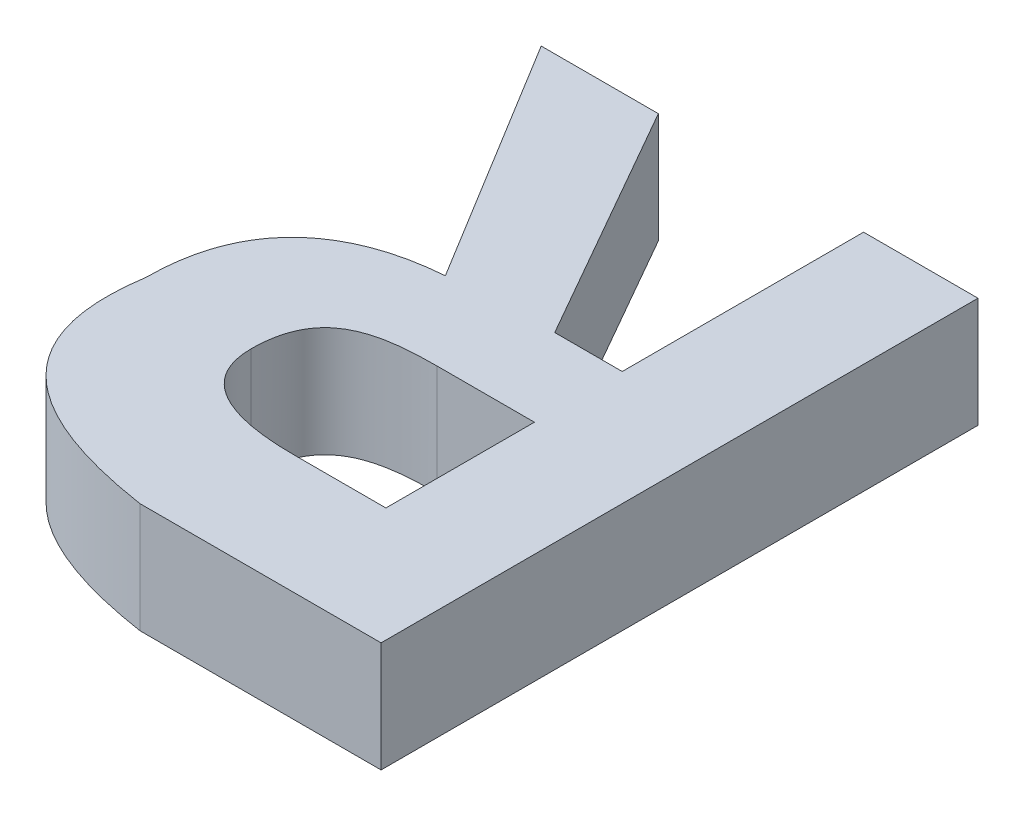
ISO-10303-21;
HEADER;
FILE_DESCRIPTION(('STEP AP214'),'2;1');
FILE_NAME('part.step','',(''),(''),'','','');
FILE_SCHEMA(('AUTOMOTIVE_DESIGN { 1 0 10303 214 1 1 1 1 }'));
ENDSEC;
DATA;
#1=APPLICATION_CONTEXT('core data for automotive mechanical design processes');
#2=APPLICATION_PROTOCOL_DEFINITION('international standard','automotive_design',2000,#1);
#3=PRODUCT_CONTEXT('',#1,'mechanical');
#4=PRODUCT('Part','Part','',(#3));
#5=PRODUCT_RELATED_PRODUCT_CATEGORY('part','',(#4));
#6=PRODUCT_DEFINITION_FORMATION('','',#4);
#7=PRODUCT_DEFINITION_CONTEXT('part definition',#1,'design');
#8=PRODUCT_DEFINITION('design','',#6,#7);
#9=PRODUCT_DEFINITION_SHAPE('','',#8);
#10=(LENGTH_UNIT() NAMED_UNIT(*) SI_UNIT(.MILLI.,.METRE.));
#11=(NAMED_UNIT(*) PLANE_ANGLE_UNIT() SI_UNIT($,.RADIAN.));
#12=(NAMED_UNIT(*) SI_UNIT($,.STERADIAN.) SOLID_ANGLE_UNIT());
#13=UNCERTAINTY_MEASURE_WITH_UNIT(LENGTH_MEASURE(1.E-05),#10,'distance_accuracy_value','');
#14=(GEOMETRIC_REPRESENTATION_CONTEXT(3) GLOBAL_UNCERTAINTY_ASSIGNED_CONTEXT((#13)) GLOBAL_UNIT_ASSIGNED_CONTEXT((#10,
#11,#12)) REPRESENTATION_CONTEXT('',''));
#15=CARTESIAN_POINT('',(0.,0.,0.));
#16=DIRECTION('',(0.,0.,1.));
#17=DIRECTION('',(1.,0.,0.));
#18=AXIS2_PLACEMENT_3D('',#15,#16,#17);
#19=CARTESIAN_POINT('',(-26.090925044,12.954,-113.771662691));
#20=DIRECTION('',(0.,1.,0.));
#21=DIRECTION('',(0.,0.,1.));
#22=AXIS2_PLACEMENT_3D('',#19,#20,#21);
#23=PLANE('',#22);
#24=DIRECTION('',(-1.,0.,0.));
#25=VECTOR('',#24,1.);
#26=CARTESIAN_POINT('',(-25.449607533,12.954,-113.012308525));
#27=LINE('',#26,#25);
#28=CARTESIAN_POINT('',(-25.3373249810244,12.954,-113.012308524818));
#29=VERTEX_POINT('',#28);
#30=CARTESIAN_POINT('',(-25.5618900849623,12.954,-113.012308525));
#31=VERTEX_POINT('',#30);
#32=EDGE_CURVE('E153',#29,#31,#27,.T.);
#33=ORIENTED_EDGE('',*,*,#32,.F.);
#34=DIRECTION('',(0.,0.,-1.));
#35=VECTOR('',#34,1.);
#36=CARTESIAN_POINT('',(-25.337324981,12.954,-112.8409908165));
#37=LINE('',#36,#35);
#38=CARTESIAN_POINT('',(-25.3373249810366,12.954,-112.66967310799));
#39=VERTEX_POINT('',#38);
#40=EDGE_CURVE('E148',#39,#29,#37,.T.);
#41=ORIENTED_EDGE('',*,*,#40,.F.);
#42=DIRECTION('',(1.,0.,0.));
#43=VECTOR('',#42,1.);
#44=CARTESIAN_POINT('',(-25.4432409965,12.954,-112.669673108));
#45=LINE('',#44,#43);
#46=CARTESIAN_POINT('',(-25.5491570120707,12.954,-112.669673108));
#47=VERTEX_POINT('',#46);
#48=EDGE_CURVE('E143',#47,#39,#45,.T.);
#49=ORIENTED_EDGE('',*,*,#48,.F.);
#50=CARTESIAN_POINT('',(-25.810763783,12.954,-112.831730399406));
#51=CARTESIAN_POINT('',(-25.8107776302854,12.954,-112.823246137175));
#52=CARTESIAN_POINT('',(-25.8102176620083,12.954,-112.814713134703));
#53=CARTESIAN_POINT('',(-25.8077368192563,12.954,-112.797807767082));
#54=CARTESIAN_POINT('',(-25.8058087399107,12.954,-112.789436494447));
#55=CARTESIAN_POINT('',(-25.8008261546182,12.954,-112.774559777378));
#56=CARTESIAN_POINT('',(-25.7980125754551,12.954,-112.767975704532));
#57=CARTESIAN_POINT('',(-25.7913051876619,12.954,-112.75541106041));
#58=CARTESIAN_POINT('',(-25.7874151974175,12.954,-112.749428455956));
#59=CARTESIAN_POINT('',(-25.778687248921,12.954,-112.738215859253));
#60=CARTESIAN_POINT('',(-25.7738503605541,12.954,-112.732985029048));
#61=CARTESIAN_POINT('',(-25.7634318066707,12.954,-112.723324557742));
#62=CARTESIAN_POINT('',(-25.757849109587,12.954,-112.718896046727));
#63=CARTESIAN_POINT('',(-25.7429409929256,12.954,-112.708592809806));
#64=CARTESIAN_POINT('',(-25.7332439867889,12.954,-112.703259638791));
#65=CARTESIAN_POINT('',(-25.7131033044583,12.954,-112.694095293888));
#66=CARTESIAN_POINT('',(-25.7026540322686,12.954,-112.690277135416));
#67=CARTESIAN_POINT('',(-25.680293518783,12.954,-112.683505543826));
#68=CARTESIAN_POINT('',(-25.6683435615107,12.954,-112.680684057106));
#69=CARTESIAN_POINT('',(-25.6442171688885,12.954,-112.676138005697));
#70=CARTESIAN_POINT('',(-25.6320402376618,12.954,-112.674416230119));
#71=CARTESIAN_POINT('',(-25.6080562417876,12.954,-112.671866120748));
#72=CARTESIAN_POINT('',(-25.5962522394757,12.954,-112.671006975831));
#73=CARTESIAN_POINT('',(-25.5726815681535,12.954,-112.669915418162));
#74=CARTESIAN_POINT('',(-25.5609150717793,12.954,-112.669679448772));
#75=CARTESIAN_POINT('',(-25.5491570121413,12.954,-112.669673108));
#76=B_SPLINE_CURVE_WITH_KNOTS('',3,(#50,#51,#52,#53,#54,#55,#56,#57,#58,#59,#60,#61,#62,#63,#64,
#65,#66,#67,#68,#69,#70,#71,#72,#73,#74,#75),.UNSPECIFIED.,.F.,.F.,(4,2,2,2,2,2,2,2,2,2,2,2,4),
(0.,0.0255099891125223,0.0511553279690348,0.0725317902280279,0.0938333743057024,
0.115111027544454,0.136418421765181,0.169428371635405,0.202716068199506,0.239480073503482,
0.276336954015739,0.311824792851989,0.347109650499031),.UNSPECIFIED.);
#77=CARTESIAN_POINT('',(-25.810763783,12.954,-112.831730399406));
#78=VERTEX_POINT('',#77);
#79=EDGE_CURVE('E228',#78,#47,#76,.T.);
#80=ORIENTED_EDGE('',*,*,#79,.F.);
#81=CARTESIAN_POINT('',(-25.5618900849246,12.954,-113.012308525));
#82=CARTESIAN_POINT('',(-25.5719312912442,12.954,-113.012301866117));
#83=CARTESIAN_POINT('',(-25.5819776566971,12.954,-113.012194755488));
#84=CARTESIAN_POINT('',(-25.6021052033692,12.954,-113.011629515633));
#85=CARTESIAN_POINT('',(-25.6121863360742,12.954,-113.011169798059));
#86=CARTESIAN_POINT('',(-25.6325860474253,12.954,-113.009727520731));
#87=CARTESIAN_POINT('',(-25.6429037559209,12.954,-113.008731290467));
#88=CARTESIAN_POINT('',(-25.6634238005514,12.954,-113.005973771035));
#89=CARTESIAN_POINT('',(-25.6736263245699,12.954,-113.004213999513));
#90=CARTESIAN_POINT('',(-25.6923369632769,12.954,-112.999941328749));
#91=CARTESIAN_POINT('',(-25.7008769587077,12.954,-112.997573930636));
#92=CARTESIAN_POINT('',(-25.7175752585948,12.954,-112.991800071061));
#93=CARTESIAN_POINT('',(-25.725734928069,12.954,-112.988397719166));
#94=CARTESIAN_POINT('',(-25.7415493628911,12.954,-112.980220518709));
#95=CARTESIAN_POINT('',(-25.7491922015037,12.954,-112.975421763746));
#96=CARTESIAN_POINT('',(-25.7633313884719,12.954,-112.964364008087));
#97=CARTESIAN_POINT('',(-25.7698306397209,12.954,-112.958108801163));
#98=CARTESIAN_POINT('',(-25.7804534282194,12.954,-112.945381473812));
#99=CARTESIAN_POINT('',(-25.7847871672812,12.954,-112.939083016556));
#100=CARTESIAN_POINT('',(-25.7923219404625,12.954,-112.925837017911));
#101=CARTESIAN_POINT('',(-25.795520952524,12.954,-112.918888345414));
#102=CARTESIAN_POINT('',(-25.8020125067607,12.954,-112.901584134861));
#103=CARTESIAN_POINT('',(-25.8047708397115,12.954,-112.891032114872));
#104=CARTESIAN_POINT('',(-25.8086745332376,12.954,-112.869648657799));
#105=CARTESIAN_POINT('',(-25.8098167899889,12.954,-112.858816723613));
#106=CARTESIAN_POINT('',(-25.8106357418109,12.954,-112.842551570542));
#107=CARTESIAN_POINT('',(-25.8107602876309,12.954,-112.837137750845));
#108=CARTESIAN_POINT('',(-25.810763783,12.954,-112.831730399406));
#109=B_SPLINE_CURVE_WITH_KNOTS('',3,(#81,#82,#83,#84,#85,#86,#87,#88,#89,#90,#91,#92,#93,#94,
#95,#96,#97,#98,#99,#100,#101,#102,#103,#104,#105,#106,#107,#108),.UNSPECIFIED.,.F.,.F.,(4,2,2,
2,2,2,2,2,2,2,2,2,2,4),(0.,0.0301311950720296,0.060398921498261,0.0914771258709669,
0.122493838815301,0.149030364951006,0.175462866363666,0.202377581623978,0.229222958484002,
0.252036607466527,0.274890708007287,0.307424124795699,0.340019940592904,0.356253469182413),.UNSPECIFIED.);
#110=EDGE_CURVE('E219',#31,#78,#109,.T.);
#111=ORIENTED_EDGE('',*,*,#110,.F.);
#112=EDGE_LOOP('',(#33,#41,#49,#80,#111));
#113=FACE_BOUND('',#112,.T.);
#114=DIRECTION('',(0.495652722488947,0.,0.868520799226648));
#115=VECTOR('',#114,1.);
#116=CARTESIAN_POINT('',(-25.6518897595,12.954,-113.493271415));
#117=LINE('',#116,#115);
#118=CARTESIAN_POINT('',(-25.8107637830514,12.954,-113.771662691));
#119=VERTEX_POINT('',#118);
#120=CARTESIAN_POINT('',(-25.4930157360467,12.954,-113.214880138876));
#121=VERTEX_POINT('',#120);
#122=EDGE_CURVE('E179',#119,#121,#117,.T.);
#123=ORIENTED_EDGE('',*,*,#122,.F.);
#124=DIRECTION('',(1.,0.,0.));
#125=VECTOR('',#124,1.);
#126=CARTESIAN_POINT('',(-25.9459079885,12.954,-113.771662691));
#127=LINE('',#126,#125);
#128=CARTESIAN_POINT('',(-26.0810521941043,12.954,-113.771662691036));
#129=VERTEX_POINT('',#128);
#130=EDGE_CURVE('E113',#129,#119,#127,.T.);
#131=ORIENTED_EDGE('',*,*,#130,.F.);
#132=DIRECTION('',(-0.521870730900118,0.,-0.853024583602241));
#133=VECTOR('',#132,1.);
#134=CARTESIAN_POINT('',(-25.9068406055,12.954,-113.4869048785));
#135=LINE('',#134,#133);
#136=CARTESIAN_POINT('',(-25.7326290170488,12.954,-113.202147065996));
#137=VERTEX_POINT('',#136);
#138=EDGE_CURVE('E110',#137,#129,#135,.T.);
#139=ORIENTED_EDGE('',*,*,#138,.F.);
#140=CARTESIAN_POINT('',(-26.074685658,12.954,-112.853723889036));
#141=CARTESIAN_POINT('',(-26.0746832927,12.954,-112.87635047769));
#142=CARTESIAN_POINT('',(-26.07335310071,12.954,-112.899168006339));
#143=CARTESIAN_POINT('',(-26.0671126607881,12.954,-112.944583141224));
#144=CARTESIAN_POINT('',(-26.0621563166214,12.954,-112.967174082605));
#145=CARTESIAN_POINT('',(-26.0498770538995,12.954,-113.004297306721));
#146=CARTESIAN_POINT('',(-26.0437213079397,12.954,-113.01920247324));
#147=CARTESIAN_POINT('',(-26.0290484920645,12.954,-113.047718809214));
#148=CARTESIAN_POINT('',(-26.0205441464802,12.954,-113.061336435204));
#149=CARTESIAN_POINT('',(-26.0011982367447,12.954,-113.086916820569));
#150=CARTESIAN_POINT('',(-25.9903446329658,12.954,-113.098870513654));
#151=CARTESIAN_POINT('',(-25.966700746293,12.954,-113.120701854276));
#152=CARTESIAN_POINT('',(-25.9539072312247,12.954,-113.130575970085));
#153=CARTESIAN_POINT('',(-25.9237998626526,12.954,-113.150200195015));
#154=CARTESIAN_POINT('',(-25.9061253965113,12.954,-113.159391710226));
#155=CARTESIAN_POINT('',(-25.8695024228251,12.954,-113.174848979438));
#156=CARTESIAN_POINT('',(-25.8505490825181,12.954,-113.181102831974));
#157=CARTESIAN_POINT('',(-25.8150611136051,12.954,-113.190365573586));
#158=CARTESIAN_POINT('',(-25.7986145017672,12.954,-113.193729978415));
#159=CARTESIAN_POINT('',(-25.7656606072858,12.954,-113.198963055576));
#160=CARTESIAN_POINT('',(-25.7491558435457,12.954,-113.200847301286));
#161=CARTESIAN_POINT('',(-25.7326290170977,12.954,-113.202147065992));
#162=B_SPLINE_CURVE_WITH_KNOTS('',3,(#140,#141,#142,#143,#144,#145,#146,#147,#148,#149,#150,
#151,#152,#153,#154,#155,#156,#157,#158,#159,#160,#161),.UNSPECIFIED.,.F.,.F.,(4,2,2,2,2,2,2,2,
2,2,4),(0.,0.0681500460575748,0.137181819994094,0.185360477353473,0.233283065163485,
0.281457323972136,0.329712748443763,0.389146600500817,0.448819205587135,0.499113530626107,
0.548871323060384),.UNSPECIFIED.);
#163=CARTESIAN_POINT('',(-26.0746856579945,12.954,-112.853723889054));
#164=VERTEX_POINT('',#163);
#165=EDGE_CURVE('E22',#164,#137,#162,.T.);
#166=ORIENTED_EDGE('',*,*,#165,.F.);
#167=CARTESIAN_POINT('',(-25.6298959589762,12.954,-112.394654170996));
#168=CARTESIAN_POINT('',(-25.6527922911345,12.954,-112.398226128867));
#169=CARTESIAN_POINT('',(-25.675636746028,12.954,-112.402271238563));
#170=CARTESIAN_POINT('',(-25.7212417198629,12.954,-112.411704988264));
#171=CARTESIAN_POINT('',(-25.7439999459293,12.954,-112.41710456262));
#172=CARTESIAN_POINT('',(-25.7903690147002,12.954,-112.42995864268));
#173=CARTESIAN_POINT('',(-25.8139529180023,12.954,-112.437514036143));
#174=CARTESIAN_POINT('',(-25.8601031972738,12.954,-112.455129826824));
#175=CARTESIAN_POINT('',(-25.8826729446044,12.954,-112.465181066093));
#176=CARTESIAN_POINT('',(-25.9256385337015,12.954,-112.488358546919));
#177=CARTESIAN_POINT('',(-25.9460697325638,12.954,-112.501416749718));
#178=CARTESIAN_POINT('',(-25.9836523361731,12.954,-112.531228359708));
#179=CARTESIAN_POINT('',(-26.0008503334594,12.954,-112.547920321955));
#180=CARTESIAN_POINT('',(-26.026187034835,12.954,-112.579430965283));
#181=CARTESIAN_POINT('',(-26.035495788569,12.954,-112.593309880974));
#182=CARTESIAN_POINT('',(-26.0515170403732,12.954,-112.622526437535));
#183=CARTESIAN_POINT('',(-26.0582247557941,12.954,-112.637866701567));
#184=CARTESIAN_POINT('',(-26.0689422009236,12.954,-112.669316414517));
#185=CARTESIAN_POINT('',(-26.072972094957,12.954,-112.685419113396));
#186=CARTESIAN_POINT('',(-26.078704807968,12.954,-112.718044023868));
#187=CARTESIAN_POINT('',(-26.0804011254355,12.954,-112.734567277412));
#188=CARTESIAN_POINT('',(-26.0825948489605,12.954,-112.785435640346));
#189=CARTESIAN_POINT('',(-26.0798832411116,12.954,-112.819990422207));
#190=CARTESIAN_POINT('',(-26.0746856579889,12.954,-112.853723889071));
#191=B_SPLINE_CURVE_WITH_KNOTS('',3,(#167,#168,#169,#170,#171,#172,#173,#174,#175,#176,#177,
#178,#179,#180,#181,#182,#183,#184,#185,#186,#187,#188,#189,#190),.UNSPECIFIED.,.F.,.F.,(4,2,2,
2,2,2,2,2,2,2,2,4),(0.,0.0695473820484863,0.139675370769989,0.213864202745999,0.287784737012076,
0.360173436055242,0.43142190335044,0.481300441560027,0.531270263704793,0.580859409112938,
0.63058643549624,0.733357096768972),.UNSPECIFIED.);
#192=CARTESIAN_POINT('',(-25.6298959589881,12.954,-112.394654170998));
#193=VERTEX_POINT('',#192);
#194=EDGE_CURVE('E239',#193,#164,#191,.T.);
#195=ORIENTED_EDGE('',*,*,#194,.F.);
#196=DIRECTION('',(-1.,0.,0.));
#197=VECTOR('',#196,1.);
#198=CARTESIAN_POINT('',(-25.3516495325,12.954,-112.394654171));
#199=LINE('',#198,#197);
#200=CARTESIAN_POINT('',(-25.073403106,12.954,-112.394654171));
#201=VERTEX_POINT('',#200);
#202=EDGE_CURVE('E164',#201,#193,#199,.T.);
#203=ORIENTED_EDGE('',*,*,#202,.F.);
#204=DIRECTION('',(0.,0.,1.));
#205=VECTOR('',#204,1.);
#206=CARTESIAN_POINT('',(-25.073403106,12.954,-113.083158431));
#207=LINE('',#206,#205);
#208=CARTESIAN_POINT('',(-25.073403106,12.954,-113.771662691));
#209=VERTEX_POINT('',#208);
#210=EDGE_CURVE('E171',#209,#201,#207,.T.);
#211=ORIENTED_EDGE('',*,*,#210,.F.);
#212=DIRECTION('',(1.,0.,0.));
#213=VECTOR('',#212,1.);
#214=CARTESIAN_POINT('',(-25.2053640435,12.954,-113.771662691));
#215=LINE('',#214,#213);
#216=CARTESIAN_POINT('',(-25.3373249810549,12.954,-113.771662691));
#217=VERTEX_POINT('',#216);
#218=EDGE_CURVE('E297',#217,#209,#215,.T.);
#219=ORIENTED_EDGE('',*,*,#218,.F.);
#220=DIRECTION('',(0.,0.,-1.));
#221=VECTOR('',#220,1.);
#222=CARTESIAN_POINT('',(-25.337324981,12.954,-113.493271415));
#223=LINE('',#222,#221);
#224=CARTESIAN_POINT('',(-25.3373249810549,12.954,-113.214880138876));
#225=VERTEX_POINT('',#224);
#226=EDGE_CURVE('E303',#225,#217,#223,.T.);
#227=ORIENTED_EDGE('',*,*,#226,.F.);
#228=DIRECTION('',(1.,0.,0.));
#229=VECTOR('',#228,1.);
#230=CARTESIAN_POINT('',(-25.4151703585,12.954,-113.214880139));
#231=LINE('',#230,#229);
#232=EDGE_CURVE('E180',#121,#225,#231,.T.);
#233=ORIENTED_EDGE('',*,*,#232,.F.);
#234=EDGE_LOOP('',(#123,#131,#139,#166,#195,#203,#211,#219,#227,#233));
#235=FACE_BOUND('',#234,.T.);
#236=ADVANCED_FACE('F17',(#113,#235),#23,.T.);
#237=CARTESIAN_POINT('',(-26.081052194,12.7,-113.771662691));
#238=DIRECTION('',(-0.853024583602241,0.,0.521870730900119));
#239=DIRECTION('',(0.521870730900119,0.,0.853024583602241));
#240=AXIS2_PLACEMENT_3D('',#237,#238,#239);
#241=PLANE('',#240);
#242=DIRECTION('',(0.,-1.,0.));
#243=VECTOR('',#242,1.);
#244=CARTESIAN_POINT('',(-25.732629017,12.827,-113.202147066));
#245=LINE('',#244,#243);
#246=CARTESIAN_POINT('',(-25.7326290170977,12.7,-113.202147065992));
#247=VERTEX_POINT('',#246);
#248=EDGE_CURVE('E118',#137,#247,#245,.T.);
#249=ORIENTED_EDGE('',*,*,#248,.F.);
#250=ORIENTED_EDGE('',*,*,#138,.T.);
#251=DIRECTION('',(0.,1.,0.));
#252=VECTOR('',#251,1.);
#253=CARTESIAN_POINT('',(-26.081052194,12.827,-113.771662691));
#254=LINE('',#253,#252);
#255=CARTESIAN_POINT('',(-26.081052194,12.7,-113.771662691));
#256=VERTEX_POINT('',#255);
#257=EDGE_CURVE('E133',#256,#129,#254,.T.);
#258=ORIENTED_EDGE('',*,*,#257,.F.);
#259=DIRECTION('',(0.521870730900119,0.,0.853024583602241));
#260=VECTOR('',#259,1.);
#261=CARTESIAN_POINT('',(-26.081052194,12.7,-113.771662691));
#262=LINE('',#261,#260);
#263=EDGE_CURVE('E128',#256,#247,#262,.T.);
#264=ORIENTED_EDGE('',*,*,#263,.T.);
#265=EDGE_LOOP('',(#249,#250,#258,#264));
#266=FACE_BOUND('',#265,.T.);
#267=ADVANCED_FACE('F127',(#266),#241,.T.);
#268=CARTESIAN_POINT('',(-26.074685658,12.9794,-112.853723889));
#269=CARTESIAN_POINT('',(-26.074685658,12.6746,-112.853723889));
#270=CARTESIAN_POINT('',(-26.074685658,12.9794,-113.09333717));
#271=CARTESIAN_POINT('',(-26.074685658,12.6746,-113.09333717));
#272=CARTESIAN_POINT('',(-25.925361439,12.9794,-113.187098889));
#273=CARTESIAN_POINT('',(-25.925361439,12.6746,-113.187098889));
#274=CARTESIAN_POINT('',(-25.732629017,12.9794,-113.202147066));
#275=CARTESIAN_POINT('',(-25.732629017,12.6746,-113.202147066));
#276=B_SPLINE_SURFACE_WITH_KNOTS('',3,1,((#268,#269),(#270,#271),(#272,#273),(#274,#275)),
.UNSPECIFIED.,.F.,.F.,.F.,(4,4),(2,2),(2.00000000000002,3.00000000000002),(0.,1.),.UNSPECIFIED.);
#277=DIRECTION('',(0.,-1.,0.));
#278=VECTOR('',#277,1.);
#279=CARTESIAN_POINT('',(-26.074685658,12.827,-112.853723889));
#280=LINE('',#279,#278);
#281=CARTESIAN_POINT('',(-26.0746856579945,12.7,-112.853723889036));
#282=VERTEX_POINT('',#281);
#283=EDGE_CURVE('E125',#164,#282,#280,.T.);
#284=CARTESIAN_POINT('',(-25.7326290171954,12.7,-113.202147065985));
#285=CARTESIAN_POINT('',(-25.7614373799831,12.7,-113.199860612178));
#286=CARTESIAN_POINT('',(-25.790524758893,12.7,-113.195782375205));
#287=CARTESIAN_POINT('',(-25.8479860923438,12.7,-113.182424372891));
#288=CARTESIAN_POINT('',(-25.8763371944466,12.7,-113.173050627157));
#289=CARTESIAN_POINT('',(-25.9177874990785,12.7,-113.153229619954));
#290=CARTESIAN_POINT('',(-25.9319960926859,12.7,-113.145175517909));
#291=CARTESIAN_POINT('',(-25.9588359548143,12.7,-113.126903699724));
#292=CARTESIAN_POINT('',(-25.971476631533,12.7,-113.116699990717));
#293=CARTESIAN_POINT('',(-25.9948332921135,12.7,-113.094119166544));
#294=CARTESIAN_POINT('',(-26.0055347774635,12.7,-113.081726945828));
#295=CARTESIAN_POINT('',(-26.0245446610619,12.7,-113.055203134));
#296=CARTESIAN_POINT('',(-26.0328487046018,12.7,-113.041068443475));
#297=CARTESIAN_POINT('',(-26.0482153714556,12.7,-113.009085805141));
#298=CARTESIAN_POINT('',(-26.0548161158686,12.7,-112.991018096483));
#299=CARTESIAN_POINT('',(-26.0650242478317,12.7,-112.954057337835));
#300=CARTESIAN_POINT('',(-26.0686236169602,12.7,-112.935162218017));
#301=CARTESIAN_POINT('',(-26.0735583629699,12.7,-112.895405392838));
#302=CARTESIAN_POINT('',(-26.0746719839459,12.7,-112.874514501954));
#303=CARTESIAN_POINT('',(-26.074685658,12.7,-112.853723889036));
#304=B_SPLINE_CURVE_WITH_KNOTS('',3,(#284,#285,#286,#287,#288,#289,#290,#291,#292,#293,#294,
#295,#296,#297,#298,#299,#300,#301,#302,#303),.UNSPECIFIED.,.F.,.F.,(4,2,2,2,2,2,2,2,2,4),(0.,
0.0873358608099145,0.176272702421927,0.225076870500929,0.273572350807906,0.322416663176126,
0.371349145967646,0.428730067027777,0.486263799214042,0.548754044361464),.UNSPECIFIED.);
#305=EDGE_CURVE('E269',#247,#282,#304,.T.);
#306=ORIENTED_EDGE('',*,*,#283,.F.);
#307=ORIENTED_EDGE('',*,*,#165,.T.);
#308=ORIENTED_EDGE('',*,*,#248,.T.);
#309=ORIENTED_EDGE('',*,*,#305,.T.);
#310=EDGE_LOOP('',(#306,#307,#308,#309));
#311=FACE_BOUND('',#310,.T.);
#312=ADVANCED_FACE('F122',(#311),#276,.T.);
#313=CARTESIAN_POINT('',(-25.629895959,12.9794,-112.394654171));
#314=CARTESIAN_POINT('',(-25.629895959,12.6746,-112.394654171));
#315=CARTESIAN_POINT('',(-25.952467907,12.9794,-112.444690952));
#316=CARTESIAN_POINT('',(-25.952467907,12.6746,-112.444690952));
#317=CARTESIAN_POINT('',(-26.118157329,12.9794,-112.573475211));
#318=CARTESIAN_POINT('',(-26.118157329,12.6746,-112.573475211));
#319=CARTESIAN_POINT('',(-26.074685658,12.9794,-112.853723889));
#320=CARTESIAN_POINT('',(-26.074685658,12.6746,-112.853723889));
#321=B_SPLINE_SURFACE_WITH_KNOTS('',3,1,((#313,#314),(#315,#316),(#317,#318),(#319,#320)),
.UNSPECIFIED.,.F.,.F.,.F.,(4,4),(2,2),(0.999999999999998,2.),(0.,1.),.UNSPECIFIED.);
#322=DIRECTION('',(0.,-1.,0.));
#323=VECTOR('',#322,1.);
#324=CARTESIAN_POINT('',(-25.629895959,12.827,-112.394654171));
#325=LINE('',#324,#323);
#326=CARTESIAN_POINT('',(-25.6298959589513,12.7,-112.394654171));
#327=VERTEX_POINT('',#326);
#328=EDGE_CURVE('E168',#193,#327,#325,.T.);
#329=CARTESIAN_POINT('',(-26.0746856579889,12.7,-112.853723889071));
#330=CARTESIAN_POINT('',(-26.0782955976191,12.7,-112.830334246345));
#331=CARTESIAN_POINT('',(-26.0807063765062,12.7,-112.80655772911));
#332=CARTESIAN_POINT('',(-26.0820056262168,12.7,-112.758578331763));
#333=CARTESIAN_POINT('',(-26.0808407182092,12.7,-112.734374406065));
#334=CARTESIAN_POINT('',(-26.0747602193918,12.7,-112.693796051073));
#335=CARTESIAN_POINT('',(-26.0710751721505,12.7,-112.677251874018));
#336=CARTESIAN_POINT('',(-26.0610348752444,12.7,-112.64508072884));
#337=CARTESIAN_POINT('',(-26.0546952977029,12.7,-112.629448981157));
#338=CARTESIAN_POINT('',(-26.0392725034929,12.7,-112.599475219434));
#339=CARTESIAN_POINT('',(-26.030172942477,12.7,-112.585141567899));
#340=CARTESIAN_POINT('',(-26.0095932620036,12.7,-112.558288981302));
#341=CARTESIAN_POINT('',(-25.9981098391465,12.7,-112.545772605843));
#342=CARTESIAN_POINT('',(-25.9697871273102,12.7,-112.51937458578));
#343=CARTESIAN_POINT('',(-25.9523569729417,12.7,-112.506133903455));
#344=CARTESIAN_POINT('',(-25.9155509227986,12.7,-112.482461596405));
#345=CARTESIAN_POINT('',(-25.8961603576416,12.7,-112.472053689187));
#346=CARTESIAN_POINT('',(-25.8565310043382,12.7,-112.453682817595));
#347=CARTESIAN_POINT('',(-25.8363032734372,12.7,-112.445695305578));
#348=CARTESIAN_POINT('',(-25.7952016187938,12.7,-112.431496779552));
#349=CARTESIAN_POINT('',(-25.7743264202313,12.7,-112.425289554063));
#350=CARTESIAN_POINT('',(-25.732912371661,12.7,-112.414450875907));
#351=CARTESIAN_POINT('',(-25.7123849699719,12.7,-112.409774390799));
#352=CARTESIAN_POINT('',(-25.6712187063083,12.7,-112.401489466));
#353=CARTESIAN_POINT('',(-25.6505808923515,12.7,-112.397875875802));
#354=CARTESIAN_POINT('',(-25.6298959589524,12.7,-112.394654170993));
#355=B_SPLINE_CURVE_WITH_KNOTS('',3,(#329,#330,#331,#332,#333,#334,#335,#336,#337,#338,#339,
#340,#341,#342,#343,#344,#345,#346,#347,#348,#349,#350,#351,#352,#353,#354),.UNSPECIFIED.,.F.,
.F.,(4,2,2,2,2,2,2,2,2,2,2,2,4),(0.,0.0712895627659838,0.143648504371037,0.194291681501308,
0.244639989834716,0.295292478313878,0.346015631929066,0.411312299086783,0.477139929649566,
0.542275683614417,0.607549037679968,0.670680025053649,0.733499856716099),.UNSPECIFIED.);
#356=EDGE_CURVE('E263',#282,#327,#355,.T.);
#357=ORIENTED_EDGE('',*,*,#328,.F.);
#358=ORIENTED_EDGE('',*,*,#194,.T.);
#359=ORIENTED_EDGE('',*,*,#283,.T.);
#360=ORIENTED_EDGE('',*,*,#356,.T.);
#361=EDGE_LOOP('',(#357,#358,#359,#360));
#362=FACE_BOUND('',#361,.T.);
#363=ADVANCED_FACE('F244',(#362),#321,.T.);
#364=CARTESIAN_POINT('',(-25.629895959,12.7,-112.394654171));
#365=DIRECTION('',(0.,0.,1.));
#366=DIRECTION('',(1.,0.,0.));
#367=AXIS2_PLACEMENT_3D('',#364,#365,#366);
#368=PLANE('',#367);
#369=DIRECTION('',(0.,-1.,0.));
#370=VECTOR('',#369,1.);
#371=CARTESIAN_POINT('',(-25.073403106,12.827,-112.394654171));
#372=LINE('',#371,#370);
#373=CARTESIAN_POINT('',(-25.073403106,12.7,-112.394654171));
#374=VERTEX_POINT('',#373);
#375=EDGE_CURVE('E167',#201,#374,#372,.T.);
#376=ORIENTED_EDGE('',*,*,#375,.F.);
#377=ORIENTED_EDGE('',*,*,#202,.T.);
#378=ORIENTED_EDGE('',*,*,#328,.T.);
#379=DIRECTION('',(1.,0.,0.));
#380=VECTOR('',#379,1.);
#381=CARTESIAN_POINT('',(-25.582164075,12.7,-112.394654171));
#382=LINE('',#381,#380);
#383=EDGE_CURVE('E268',#327,#374,#382,.T.);
#384=ORIENTED_EDGE('',*,*,#383,.T.);
#385=EDGE_LOOP('',(#376,#377,#378,#384));
#386=FACE_BOUND('',#385,.T.);
#387=ADVANCED_FACE('F250',(#386),#368,.T.);
#388=CARTESIAN_POINT('',(-25.073403106,12.7,-112.394654171));
#389=DIRECTION('',(1.,0.,0.));
#390=DIRECTION('',(0.,0.,-1.));
#391=AXIS2_PLACEMENT_3D('',#388,#389,#390);
#392=PLANE('',#391);
#393=DIRECTION('',(0.,-1.,0.));
#394=VECTOR('',#393,1.);
#395=CARTESIAN_POINT('',(-25.073403106,12.827,-113.771662691));
#396=LINE('',#395,#394);
#397=CARTESIAN_POINT('',(-25.073403106,12.7,-113.771662691));
#398=VERTEX_POINT('',#397);
#399=EDGE_CURVE('E174',#209,#398,#396,.T.);
#400=ORIENTED_EDGE('',*,*,#399,.F.);
#401=ORIENTED_EDGE('',*,*,#210,.T.);
#402=ORIENTED_EDGE('',*,*,#375,.T.);
#403=DIRECTION('',(0.,0.,-1.));
#404=VECTOR('',#403,1.);
#405=CARTESIAN_POINT('',(-25.073403106,12.7,-113.083158431));
#406=LINE('',#405,#404);
#407=EDGE_CURVE('E291',#374,#398,#406,.T.);
#408=ORIENTED_EDGE('',*,*,#407,.T.);
#409=EDGE_LOOP('',(#400,#401,#402,#408));
#410=FACE_BOUND('',#409,.T.);
#411=ADVANCED_FACE('F419',(#410),#392,.T.);
#412=CARTESIAN_POINT('',(-25.073403106,12.7,-113.771662691));
#413=DIRECTION('',(0.,0.,-1.));
#414=DIRECTION('',(-1.,0.,0.));
#415=AXIS2_PLACEMENT_3D('',#412,#413,#414);
#416=PLANE('',#415);
#417=DIRECTION('',(0.,-1.,0.));
#418=VECTOR('',#417,1.);
#419=CARTESIAN_POINT('',(-25.337324981,12.827,-113.771662691));
#420=LINE('',#419,#418);
#421=CARTESIAN_POINT('',(-25.3373249810549,12.7,-113.771662691));
#422=VERTEX_POINT('',#421);
#423=EDGE_CURVE('E300',#217,#422,#420,.T.);
#424=ORIENTED_EDGE('',*,*,#423,.F.);
#425=ORIENTED_EDGE('',*,*,#218,.T.);
#426=ORIENTED_EDGE('',*,*,#399,.T.);
#427=DIRECTION('',(-1.,0.,0.));
#428=VECTOR('',#427,1.);
#429=CARTESIAN_POINT('',(-25.582164075,12.7,-113.771662691));
#430=LINE('',#429,#428);
#431=EDGE_CURVE('E293',#398,#422,#430,.T.);
#432=ORIENTED_EDGE('',*,*,#431,.T.);
#433=EDGE_LOOP('',(#424,#425,#426,#432));
#434=FACE_BOUND('',#433,.T.);
#435=ADVANCED_FACE('F411',(#434),#416,.T.);
#436=CARTESIAN_POINT('',(-25.337324981,12.7,-113.771662691));
#437=DIRECTION('',(-1.,0.,0.));
#438=DIRECTION('',(0.,0.,1.));
#439=AXIS2_PLACEMENT_3D('',#436,#437,#438);
#440=PLANE('',#439);
#441=DIRECTION('',(0.,-1.,0.));
#442=VECTOR('',#441,1.);
#443=CARTESIAN_POINT('',(-25.337324981,12.827,-113.214880139));
#444=LINE('',#443,#442);
#445=CARTESIAN_POINT('',(-25.3373249810549,12.7,-113.214880138876));
#446=VERTEX_POINT('',#445);
#447=EDGE_CURVE('E306',#225,#446,#444,.T.);
#448=ORIENTED_EDGE('',*,*,#447,.F.);
#449=ORIENTED_EDGE('',*,*,#226,.T.);
#450=ORIENTED_EDGE('',*,*,#423,.T.);
#451=DIRECTION('',(0.,0.,1.));
#452=VECTOR('',#451,1.);
#453=CARTESIAN_POINT('',(-25.3373249812195,12.7,-113.083158431));
#454=LINE('',#453,#452);
#455=EDGE_CURVE('E184',#422,#446,#454,.T.);
#456=ORIENTED_EDGE('',*,*,#455,.T.);
#457=EDGE_LOOP('',(#448,#449,#450,#456));
#458=FACE_BOUND('',#457,.T.);
#459=ADVANCED_FACE('F403',(#458),#440,.T.);
#460=CARTESIAN_POINT('',(-25.337324981,12.7,-113.214880139));
#461=DIRECTION('',(0.,0.,-1.));
#462=DIRECTION('',(-1.,0.,0.));
#463=AXIS2_PLACEMENT_3D('',#460,#461,#462);
#464=PLANE('',#463);
#465=DIRECTION('',(0.,-1.,0.));
#466=VECTOR('',#465,1.);
#467=CARTESIAN_POINT('',(-25.493015736,12.827,-113.214880139));
#468=LINE('',#467,#466);
#469=CARTESIAN_POINT('',(-25.4930157358582,12.7,-113.214880138752));
#470=VERTEX_POINT('',#469);
#471=EDGE_CURVE('E177',#121,#470,#468,.T.);
#472=ORIENTED_EDGE('',*,*,#471,.F.);
#473=ORIENTED_EDGE('',*,*,#232,.T.);
#474=ORIENTED_EDGE('',*,*,#447,.T.);
#475=DIRECTION('',(-1.,0.,0.));
#476=VECTOR('',#475,1.);
#477=CARTESIAN_POINT('',(-25.582164075,12.7,-113.214880138503));
#478=LINE('',#477,#476);
#479=EDGE_CURVE('E181',#446,#470,#478,.T.);
#480=ORIENTED_EDGE('',*,*,#479,.T.);
#481=EDGE_LOOP('',(#472,#473,#474,#480));
#482=FACE_BOUND('',#481,.T.);
#483=ADVANCED_FACE('F395',(#482),#464,.T.);
#484=CARTESIAN_POINT('',(-25.493015736,12.7,-113.214880139));
#485=DIRECTION('',(0.868520799226648,0.,-0.495652722488947));
#486=DIRECTION('',(-0.495652722488947,0.,-0.868520799226648));
#487=AXIS2_PLACEMENT_3D('',#484,#485,#486);
#488=PLANE('',#487);
#489=DIRECTION('',(0.,-1.,0.));
#490=VECTOR('',#489,1.);
#491=CARTESIAN_POINT('',(-25.810763783,12.827,-113.771662691));
#492=LINE('',#491,#490);
#493=CARTESIAN_POINT('',(-25.810763783,12.7,-113.771662691));
#494=VERTEX_POINT('',#493);
#495=EDGE_CURVE('E135',#119,#494,#492,.T.);
#496=ORIENTED_EDGE('',*,*,#495,.F.);
#497=ORIENTED_EDGE('',*,*,#122,.T.);
#498=ORIENTED_EDGE('',*,*,#471,.T.);
#499=DIRECTION('',(-0.495652722488947,0.,-0.868520799226648));
#500=VECTOR('',#499,1.);
#501=CARTESIAN_POINT('',(-25.493015736,12.7,-113.214880139));
#502=LINE('',#501,#500);
#503=EDGE_CURVE('E142',#470,#494,#502,.T.);
#504=ORIENTED_EDGE('',*,*,#503,.T.);
#505=EDGE_LOOP('',(#496,#497,#498,#504));
#506=FACE_BOUND('',#505,.T.);
#507=ADVANCED_FACE('F387',(#506),#488,.T.);
#508=CARTESIAN_POINT('',(-25.810763783,12.7,-113.771662691));
#509=DIRECTION('',(0.,0.,-1.));
#510=DIRECTION('',(-1.,0.,0.));
#511=AXIS2_PLACEMENT_3D('',#508,#509,#510);
#512=PLANE('',#511);
#513=ORIENTED_EDGE('',*,*,#257,.T.);
#514=ORIENTED_EDGE('',*,*,#130,.T.);
#515=ORIENTED_EDGE('',*,*,#495,.T.);
#516=DIRECTION('',(-1.,0.,0.));
#517=VECTOR('',#516,1.);
#518=CARTESIAN_POINT('',(-25.582164075,12.7,-113.771662691));
#519=LINE('',#518,#517);
#520=EDGE_CURVE('E138',#494,#256,#519,.T.);
#521=ORIENTED_EDGE('',*,*,#520,.T.);
#522=EDGE_LOOP('',(#513,#514,#515,#521));
#523=FACE_BOUND('',#522,.T.);
#524=ADVANCED_FACE('F381',(#523),#512,.T.);
#525=CARTESIAN_POINT('',(-25.337324981,12.7,-112.669673108));
#526=DIRECTION('',(0.,0.,-1.));
#527=DIRECTION('',(-1.,0.,0.));
#528=AXIS2_PLACEMENT_3D('',#525,#526,#527);
#529=PLANE('',#528);
#530=DIRECTION('',(0.,-1.,0.));
#531=VECTOR('',#530,1.);
#532=CARTESIAN_POINT('',(-25.549157012,12.827,-112.669673108));
#533=LINE('',#532,#531);
#534=CARTESIAN_POINT('',(-25.5491570121413,12.7,-112.669673107985));
#535=VERTEX_POINT('',#534);
#536=EDGE_CURVE('E145',#47,#535,#533,.T.);
#537=ORIENTED_EDGE('',*,*,#536,.F.);
#538=ORIENTED_EDGE('',*,*,#48,.T.);
#539=DIRECTION('',(0.,1.,0.));
#540=VECTOR('',#539,1.);
#541=CARTESIAN_POINT('',(-25.337324981,12.827,-112.669673108));
#542=LINE('',#541,#540);
#543=CARTESIAN_POINT('',(-25.3373249811463,12.7,-112.669673107971));
#544=VERTEX_POINT('',#543);
#545=EDGE_CURVE('E150',#544,#39,#542,.T.);
#546=ORIENTED_EDGE('',*,*,#545,.F.);
#547=DIRECTION('',(-1.,0.,0.));
#548=VECTOR('',#547,1.);
#549=CARTESIAN_POINT('',(-25.582164075,12.7,-112.669673107942));
#550=LINE('',#549,#548);
#551=EDGE_CURVE('E141',#544,#535,#550,.T.);
#552=ORIENTED_EDGE('',*,*,#551,.T.);
#553=EDGE_LOOP('',(#537,#538,#546,#552));
#554=FACE_BOUND('',#553,.T.);
#555=ADVANCED_FACE('F353',(#554),#529,.T.);
#556=CARTESIAN_POINT('',(-25.810763783,12.9794,-112.8317304));
#557=CARTESIAN_POINT('',(-25.810763783,12.6746,-112.8317304));
#558=CARTESIAN_POINT('',(-25.810763783,12.9794,-112.691666597));
#559=CARTESIAN_POINT('',(-25.810763783,12.6746,-112.691666597));
#560=CARTESIAN_POINT('',(-25.661439564,12.9794,-112.669673108));
#561=CARTESIAN_POINT('',(-25.661439564,12.6746,-112.669673108));
#562=CARTESIAN_POINT('',(-25.549157012,12.9794,-112.669673108));
#563=CARTESIAN_POINT('',(-25.549157012,12.6746,-112.669673108));
#564=B_SPLINE_SURFACE_WITH_KNOTS('',3,1,((#556,#557),(#558,#559),(#560,#561),(#562,#563)),
.UNSPECIFIED.,.F.,.F.,.F.,(4,4),(2,2),(2.,3.),(0.,1.),.UNSPECIFIED.);
#565=DIRECTION('',(0.,-1.,0.));
#566=VECTOR('',#565,1.);
#567=CARTESIAN_POINT('',(-25.810763783,12.827,-112.8317304));
#568=LINE('',#567,#566);
#569=CARTESIAN_POINT('',(-25.810763783,12.7,-112.831730399703));
#570=VERTEX_POINT('',#569);
#571=EDGE_CURVE('E226',#78,#570,#568,.T.);
#572=CARTESIAN_POINT('',(-25.5491570122827,12.7,-112.669673108));
#573=CARTESIAN_POINT('',(-25.5638791168965,12.7,-112.669693090874));
#574=CARTESIAN_POINT('',(-25.5786237124996,12.7,-112.670055564566));
#575=CARTESIAN_POINT('',(-25.6082727274878,12.7,-112.671824692626));
#576=CARTESIAN_POINT('',(-25.6231761357463,12.7,-112.673247255352));
#577=CARTESIAN_POINT('',(-25.6528476091334,12.7,-112.677523713351));
#578=CARTESIAN_POINT('',(-25.6676150816141,12.7,-112.680382217008));
#579=CARTESIAN_POINT('',(-25.6965501894459,12.7,-112.688082628309));
#580=CARTESIAN_POINT('',(-25.7107208542424,12.7,-112.692912713207));
#581=CARTESIAN_POINT('',(-25.7391067205222,12.7,-112.706041935854));
#582=CARTESIAN_POINT('',(-25.7532124650573,12.7,-112.714612792995));
#583=CARTESIAN_POINT('',(-25.7717007825513,12.7,-112.730737879862));
#584=CARTESIAN_POINT('',(-25.7774494940139,12.7,-112.736711949543));
#585=CARTESIAN_POINT('',(-25.7876631823907,12.7,-112.749669149596));
#586=CARTESIAN_POINT('',(-25.7921301629072,12.7,-112.756650679141));
#587=CARTESIAN_POINT('',(-25.7991329812927,12.7,-112.770452567324));
#588=CARTESIAN_POINT('',(-25.8018380794117,12.7,-112.777188405031));
#589=CARTESIAN_POINT('',(-25.806141243047,12.7,-112.791021816409));
#590=CARTESIAN_POINT('',(-25.8077360002284,12.7,-112.798120404041));
#591=CARTESIAN_POINT('',(-25.8095023804483,12.7,-112.809674593844));
#592=CARTESIAN_POINT('',(-25.8099860928144,12.7,-112.814087110945));
#593=CARTESIAN_POINT('',(-25.8106156252707,12.7,-112.822910396236));
#594=CARTESIAN_POINT('',(-25.8107634302154,12.7,-112.827321019911));
#595=CARTESIAN_POINT('',(-25.810763783,12.7,-112.831730399406));
#596=B_SPLINE_CURVE_WITH_KNOTS('',3,(#572,#573,#574,#575,#576,#577,#578,#579,#580,#581,#582,
#583,#584,#585,#586,#587,#588,#589,#590,#591,#592,#593,#594,#595),.UNSPECIFIED.,.F.,.F.,(4,2,2,
2,2,2,2,2,2,2,2,4),(0.,0.0441965121864164,0.0890699687881781,0.134088367379625,
0.178840685252643,0.227597121657765,0.252328317910948,0.277020641068499,0.298696170470536,
0.320436010319303,0.333741447447274,0.346968056919915),.UNSPECIFIED.);
#597=EDGE_CURVE('E193',#535,#570,#596,.T.);
#598=ORIENTED_EDGE('',*,*,#571,.F.);
#599=ORIENTED_EDGE('',*,*,#79,.T.);
#600=ORIENTED_EDGE('',*,*,#536,.T.);
#601=ORIENTED_EDGE('',*,*,#597,.T.);
#602=EDGE_LOOP('',(#598,#599,#600,#601));
#603=FACE_BOUND('',#602,.T.);
#604=ADVANCED_FACE('F206',(#603),#564,.T.);
#605=CARTESIAN_POINT('',(-25.561890085,12.9794,-113.012308525));
#606=CARTESIAN_POINT('',(-25.561890085,12.6746,-113.012308525));
#607=CARTESIAN_POINT('',(-25.701953887,12.9794,-113.012308525));
#608=CARTESIAN_POINT('',(-25.701953887,12.6746,-113.012308525));
#609=CARTESIAN_POINT('',(-25.810763783,12.9794,-112.990315035));
#610=CARTESIAN_POINT('',(-25.810763783,12.6746,-112.990315035));
#611=CARTESIAN_POINT('',(-25.810763783,12.9794,-112.8317304));
#612=CARTESIAN_POINT('',(-25.810763783,12.6746,-112.8317304));
#613=B_SPLINE_SURFACE_WITH_KNOTS('',3,1,((#605,#606),(#607,#608),(#609,#610),(#611,#612)),
.UNSPECIFIED.,.F.,.F.,.F.,(4,4),(2,2),(0.999999999999992,2.00000000000001),(0.,1.),.UNSPECIFIED.);
#614=DIRECTION('',(0.,-1.,0.));
#615=VECTOR('',#614,1.);
#616=CARTESIAN_POINT('',(-25.561890085,12.827,-113.012308525));
#617=LINE('',#616,#615);
#618=CARTESIAN_POINT('',(-25.5618900848491,12.7,-113.012308524455));
#619=VERTEX_POINT('',#618);
#620=EDGE_CURVE('E156',#31,#619,#617,.T.);
#621=CARTESIAN_POINT('',(-25.810763783,12.7,-112.831730399406));
#622=CARTESIAN_POINT('',(-25.8107370722538,12.7,-112.845462625353));
#623=CARTESIAN_POINT('',(-25.8099441225056,12.7,-112.859442540284));
#624=CARTESIAN_POINT('',(-25.8058127640183,12.7,-112.887291081673));
#625=CARTESIAN_POINT('',(-25.8024208272758,12.7,-112.901151087906));
#626=CARTESIAN_POINT('',(-25.7944680060671,12.7,-112.921245889888));
#627=CARTESIAN_POINT('',(-25.7912249785832,12.7,-112.927978899112));
#628=CARTESIAN_POINT('',(-25.7836721903824,12.7,-112.940757086986));
#629=CARTESIAN_POINT('',(-25.7793706170632,12.7,-112.94680704799));
#630=CARTESIAN_POINT('',(-25.7697297555587,12.7,-112.958071024297));
#631=CARTESIAN_POINT('',(-25.7643852205239,12.7,-112.963280558911));
#632=CARTESIAN_POINT('',(-25.7528772116812,12.7,-112.972713151742));
#633=CARTESIAN_POINT('',(-25.7467119303689,12.7,-112.976933974241));
#634=CARTESIAN_POINT('',(-25.7313017749689,12.7,-112.985882849607));
#635=CARTESIAN_POINT('',(-25.7217983279565,12.7,-112.99015916127));
#636=CARTESIAN_POINT('',(-25.7022062775485,12.7,-112.99725182804));
#637=CARTESIAN_POINT('',(-25.6921134148931,12.7,-113.000055565497));
#638=CARTESIAN_POINT('',(-25.6719126812596,12.7,-113.004531298096));
#639=CARTESIAN_POINT('',(-25.6618094828183,12.7,-113.006225605963));
#640=CARTESIAN_POINT('',(-25.64149536524,12.7,-113.008880035447));
#641=CARTESIAN_POINT('',(-25.6312842868875,12.7,-113.009838850167));
#642=CARTESIAN_POINT('',(-25.6111923397534,12.7,-113.011219032351));
#643=CARTESIAN_POINT('',(-25.601312563638,12.7,-113.011658207108));
#644=CARTESIAN_POINT('',(-25.5815836765857,12.7,-113.012199239807));
#645=CARTESIAN_POINT('',(-25.571734606749,12.7,-113.012302478313));
#646=CARTESIAN_POINT('',(-25.5618900848491,12.7,-113.012308525));
#647=B_SPLINE_CURVE_WITH_KNOTS('',3,(#621,#622,#623,#624,#625,#626,#627,#628,#629,#630,#631,
#632,#633,#634,#635,#636,#637,#638,#639,#640,#641,#642,#643,#644,#645,#646),.UNSPECIFIED.,.F.,
.F.,(4,2,2,2,2,2,2,2,2,2,2,2,4),(0.,0.0415892876793386,0.0840589545505769,0.106381644196219,
0.128536824049828,0.150806475697757,0.173126008517464,0.204210609824288,0.235557382564098,
0.266252590377797,0.29700221493283,0.326664402288762,0.356204535007836),.UNSPECIFIED.);
#648=EDGE_CURVE('E186',#570,#619,#647,.T.);
#649=ORIENTED_EDGE('',*,*,#620,.F.);
#650=ORIENTED_EDGE('',*,*,#110,.T.);
#651=ORIENTED_EDGE('',*,*,#571,.T.);
#652=ORIENTED_EDGE('',*,*,#648,.T.);
#653=EDGE_LOOP('',(#649,#650,#651,#652));
#654=FACE_BOUND('',#653,.T.);
#655=ADVANCED_FACE('F199',(#654),#613,.T.);
#656=CARTESIAN_POINT('',(-25.561890085,12.7,-113.012308525));
#657=DIRECTION('',(0.,0.,1.));
#658=DIRECTION('',(1.,0.,0.));
#659=AXIS2_PLACEMENT_3D('',#656,#657,#658);
#660=PLANE('',#659);
#661=DIRECTION('',(0.,-1.,0.));
#662=VECTOR('',#661,1.);
#663=CARTESIAN_POINT('',(-25.337324981,12.827,-113.012308525));
#664=LINE('',#663,#662);
#665=CARTESIAN_POINT('',(-25.3373249811463,12.7,-113.012308524273));
#666=VERTEX_POINT('',#665);
#667=EDGE_CURVE('E41',#29,#666,#664,.T.);
#668=ORIENTED_EDGE('',*,*,#667,.F.);
#669=ORIENTED_EDGE('',*,*,#32,.T.);
#670=ORIENTED_EDGE('',*,*,#620,.T.);
#671=DIRECTION('',(1.,0.,0.));
#672=VECTOR('',#671,1.);
#673=CARTESIAN_POINT('',(-25.582164075,12.7,-113.01230852391));
#674=LINE('',#673,#672);
#675=EDGE_CURVE('E33',#619,#666,#674,.T.);
#676=ORIENTED_EDGE('',*,*,#675,.T.);
#677=EDGE_LOOP('',(#668,#669,#670,#676));
#678=FACE_BOUND('',#677,.T.);
#679=ADVANCED_FACE('F205',(#678),#660,.T.);
#680=CARTESIAN_POINT('',(-25.337324981,12.7,-113.012308525));
#681=DIRECTION('',(-1.,0.,0.));
#682=DIRECTION('',(0.,0.,1.));
#683=AXIS2_PLACEMENT_3D('',#680,#681,#682);
#684=PLANE('',#683);
#685=ORIENTED_EDGE('',*,*,#545,.T.);
#686=ORIENTED_EDGE('',*,*,#40,.T.);
#687=ORIENTED_EDGE('',*,*,#667,.T.);
#688=DIRECTION('',(0.,0.,1.));
#689=VECTOR('',#688,1.);
#690=CARTESIAN_POINT('',(-25.3373249812195,12.7,-113.083158431));
#691=LINE('',#690,#689);
#692=EDGE_CURVE('E11',#666,#544,#691,.T.);
#693=ORIENTED_EDGE('',*,*,#692,.T.);
#694=EDGE_LOOP('',(#685,#686,#687,#693));
#695=FACE_BOUND('',#694,.T.);
#696=ADVANCED_FACE('F355',(#695),#684,.T.);
#697=CARTESIAN_POINT('',(-26.090925044,12.7,-113.771662691));
#698=DIRECTION('',(0.,1.,0.));
#699=DIRECTION('',(0.,0.,1.));
#700=AXIS2_PLACEMENT_3D('',#697,#698,#699);
#701=PLANE('',#700);
#702=ORIENTED_EDGE('',*,*,#675,.F.);
#703=ORIENTED_EDGE('',*,*,#648,.F.);
#704=ORIENTED_EDGE('',*,*,#597,.F.);
#705=ORIENTED_EDGE('',*,*,#551,.F.);
#706=ORIENTED_EDGE('',*,*,#692,.F.);
#707=EDGE_LOOP('',(#702,#703,#704,#705,#706));
#708=FACE_BOUND('',#707,.T.);
#709=ORIENTED_EDGE('',*,*,#503,.F.);
#710=ORIENTED_EDGE('',*,*,#479,.F.);
#711=ORIENTED_EDGE('',*,*,#455,.F.);
#712=ORIENTED_EDGE('',*,*,#431,.F.);
#713=ORIENTED_EDGE('',*,*,#407,.F.);
#714=ORIENTED_EDGE('',*,*,#383,.F.);
#715=ORIENTED_EDGE('',*,*,#356,.F.);
#716=ORIENTED_EDGE('',*,*,#305,.F.);
#717=ORIENTED_EDGE('',*,*,#263,.F.);
#718=ORIENTED_EDGE('',*,*,#520,.F.);
#719=EDGE_LOOP('',(#709,#710,#711,#712,#713,#714,#715,#716,#717,#718));
#720=FACE_BOUND('',#719,.T.);
#721=ADVANCED_FACE('F19',(#708,#720),#701,.F.);
#722=CLOSED_SHELL('',(#236,#267,#312,#363,#387,#411,#435,#459,#483,#507,#524,#555,#604,#655,
#679,#696,#721));
#723=MANIFOLD_SOLID_BREP('B1',#722);
#724=ADVANCED_BREP_SHAPE_REPRESENTATION('',(#18,#723),#14);
#725=SHAPE_DEFINITION_REPRESENTATION(#9,#724);
ENDSEC;
END-ISO-10303-21;
